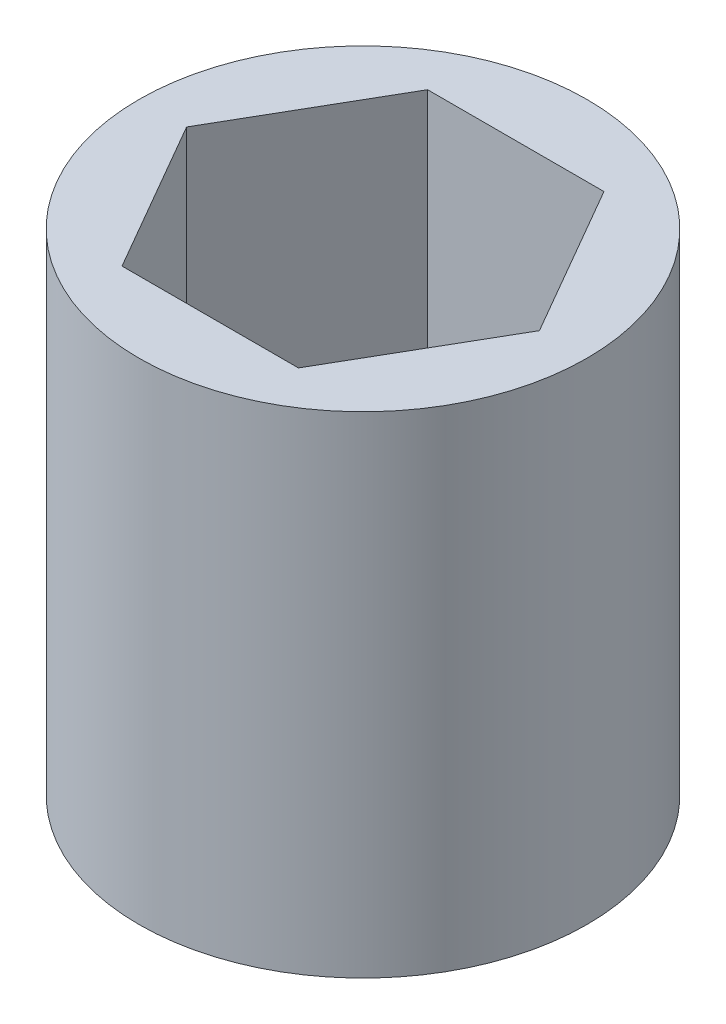
ISO-10303-21;
HEADER;
FILE_DESCRIPTION(('STEP AP214'),'2;1');
FILE_NAME('part.step','',(''),(''),'','','');
FILE_SCHEMA(('AUTOMOTIVE_DESIGN { 1 0 10303 214 1 1 1 1 }'));
ENDSEC;
DATA;
#1=APPLICATION_CONTEXT('core data for automotive mechanical design processes');
#2=APPLICATION_PROTOCOL_DEFINITION('international standard','automotive_design',2000,#1);
#3=PRODUCT_CONTEXT('',#1,'mechanical');
#4=PRODUCT('Part','Part','',(#3));
#5=PRODUCT_RELATED_PRODUCT_CATEGORY('part','',(#4));
#6=PRODUCT_DEFINITION_FORMATION('','',#4);
#7=PRODUCT_DEFINITION_CONTEXT('part definition',#1,'design');
#8=PRODUCT_DEFINITION('design','',#6,#7);
#9=PRODUCT_DEFINITION_SHAPE('','',#8);
#10=(LENGTH_UNIT() NAMED_UNIT(*) SI_UNIT(.MILLI.,.METRE.));
#11=(NAMED_UNIT(*) PLANE_ANGLE_UNIT() SI_UNIT($,.RADIAN.));
#12=(NAMED_UNIT(*) SI_UNIT($,.STERADIAN.) SOLID_ANGLE_UNIT());
#13=UNCERTAINTY_MEASURE_WITH_UNIT(LENGTH_MEASURE(1.E-05),#10,'distance_accuracy_value','');
#14=(GEOMETRIC_REPRESENTATION_CONTEXT(3) GLOBAL_UNCERTAINTY_ASSIGNED_CONTEXT((#13)) GLOBAL_UNIT_ASSIGNED_CONTEXT((#10,
#11,#12)) REPRESENTATION_CONTEXT('',''));
#15=CARTESIAN_POINT('',(0.,0.,0.));
#16=DIRECTION('',(0.,0.,1.));
#17=DIRECTION('',(1.,0.,0.));
#18=AXIS2_PLACEMENT_3D('',#15,#16,#17);
#19=CARTESIAN_POINT('',(0.,3.8227,0.));
#20=DIRECTION('',(0.,1.,0.));
#21=DIRECTION('',(0.,0.,1.));
#22=AXIS2_PLACEMENT_3D('',#19,#20,#21);
#23=PLANE('',#22);
#24=CARTESIAN_POINT('',(0.,3.8227,0.));
#25=DIRECTION('',(0.,1.,0.));
#26=DIRECTION('',(0.,0.,1.));
#27=AXIS2_PLACEMENT_3D('',#24,#25,#26);
#28=CIRCLE('',#27,3.4925);
#29=CARTESIAN_POINT('',(0.,3.8227,3.4925));
#30=VERTEX_POINT('',#29);
#31=EDGE_CURVE('E11',#30,#30,#28,.T.);
#32=ORIENTED_EDGE('',*,*,#31,.T.);
#33=EDGE_LOOP('',(#32));
#34=FACE_BOUND('',#33,.T.);
#35=DIRECTION('',(0.5,0.,-0.866025403784439));
#36=VECTOR('',#35,1.);
#37=CARTESIAN_POINT('',(1.3748153285078,3.8227,2.38125));
#38=LINE('',#37,#36);
#39=CARTESIAN_POINT('',(1.3748153285078,3.8227,2.38125));
#40=VERTEX_POINT('',#39);
#41=CARTESIAN_POINT('',(2.74963065701559,3.8227,0.));
#42=VERTEX_POINT('',#41);
#43=EDGE_CURVE('E102',#40,#42,#38,.T.);
#44=ORIENTED_EDGE('',*,*,#43,.F.);
#45=DIRECTION('',(1.,0.,0.));
#46=VECTOR('',#45,1.);
#47=CARTESIAN_POINT('',(-1.3748153285078,3.8227,2.38125));
#48=LINE('',#47,#46);
#49=CARTESIAN_POINT('',(-1.3748153285078,3.8227,2.38125));
#50=VERTEX_POINT('',#49);
#51=EDGE_CURVE('E93',#50,#40,#48,.T.);
#52=ORIENTED_EDGE('',*,*,#51,.F.);
#53=DIRECTION('',(0.5,0.,0.866025403784439));
#54=VECTOR('',#53,1.);
#55=CARTESIAN_POINT('',(-2.74963065701559,3.8227,0.));
#56=LINE('',#55,#54);
#57=CARTESIAN_POINT('',(-2.74963065701559,3.8227,0.));
#58=VERTEX_POINT('',#57);
#59=EDGE_CURVE('E127',#58,#50,#56,.T.);
#60=ORIENTED_EDGE('',*,*,#59,.F.);
#61=DIRECTION('',(-0.5,0.,0.866025403784439));
#62=VECTOR('',#61,1.);
#63=CARTESIAN_POINT('',(-1.3748153285078,3.8227,-2.38125));
#64=LINE('',#63,#62);
#65=CARTESIAN_POINT('',(-1.3748153285078,3.8227,-2.38125));
#66=VERTEX_POINT('',#65);
#67=EDGE_CURVE('E124',#66,#58,#64,.T.);
#68=ORIENTED_EDGE('',*,*,#67,.F.);
#69=DIRECTION('',(-1.,0.,0.));
#70=VECTOR('',#69,1.);
#71=CARTESIAN_POINT('',(1.3748153285078,3.8227,-2.38125));
#72=LINE('',#71,#70);
#73=CARTESIAN_POINT('',(1.3748153285078,3.8227,-2.38125));
#74=VERTEX_POINT('',#73);
#75=EDGE_CURVE('E119',#74,#66,#72,.T.);
#76=ORIENTED_EDGE('',*,*,#75,.F.);
#77=DIRECTION('',(-0.5,0.,-0.866025403784438));
#78=VECTOR('',#77,1.);
#79=CARTESIAN_POINT('',(2.74963065701559,3.8227,0.));
#80=LINE('',#79,#78);
#81=EDGE_CURVE('E115',#42,#74,#80,.T.);
#82=ORIENTED_EDGE('',*,*,#81,.F.);
#83=EDGE_LOOP('',(#44,#52,#60,#68,#76,#82));
#84=FACE_BOUND('',#83,.T.);
#85=ADVANCED_FACE('F39',(#34,#84),#23,.T.);
#86=CARTESIAN_POINT('',(0.,-3.8227,0.));
#87=DIRECTION('',(0.,1.,0.));
#88=DIRECTION('',(0.,0.,1.));
#89=AXIS2_PLACEMENT_3D('',#86,#87,#88);
#90=PLANE('',#89);
#91=CARTESIAN_POINT('',(0.,-3.8227,0.));
#92=DIRECTION('',(0.,1.,0.));
#93=DIRECTION('',(0.,0.,1.));
#94=AXIS2_PLACEMENT_3D('',#91,#92,#93);
#95=CIRCLE('',#94,3.4925);
#96=CARTESIAN_POINT('',(0.,-3.8227,3.4925));
#97=VERTEX_POINT('',#96);
#98=EDGE_CURVE('E43',#97,#97,#95,.T.);
#99=ORIENTED_EDGE('',*,*,#98,.F.);
#100=EDGE_LOOP('',(#99));
#101=FACE_BOUND('',#100,.T.);
#102=DIRECTION('',(1.,0.,0.));
#103=VECTOR('',#102,1.);
#104=CARTESIAN_POINT('',(-1.3748153285078,-3.8227,2.38125));
#105=LINE('',#104,#103);
#106=CARTESIAN_POINT('',(-1.3748153285078,-3.8227,2.38125));
#107=VERTEX_POINT('',#106);
#108=CARTESIAN_POINT('',(1.3748153285078,-3.8227,2.38125));
#109=VERTEX_POINT('',#108);
#110=EDGE_CURVE('E63',#107,#109,#105,.T.);
#111=ORIENTED_EDGE('',*,*,#110,.T.);
#112=DIRECTION('',(0.5,0.,-0.866025403784439));
#113=VECTOR('',#112,1.);
#114=CARTESIAN_POINT('',(1.3748153285078,-3.8227,2.38125));
#115=LINE('',#114,#113);
#116=CARTESIAN_POINT('',(2.74963065701559,-3.8227,0.));
#117=VERTEX_POINT('',#116);
#118=EDGE_CURVE('E109',#109,#117,#115,.T.);
#119=ORIENTED_EDGE('',*,*,#118,.T.);
#120=DIRECTION('',(-0.5,0.,-0.866025403784438));
#121=VECTOR('',#120,1.);
#122=CARTESIAN_POINT('',(2.74963065701559,-3.8227,0.));
#123=LINE('',#122,#121);
#124=CARTESIAN_POINT('',(1.3748153285078,-3.8227,-2.38125));
#125=VERTEX_POINT('',#124);
#126=EDGE_CURVE('E134',#117,#125,#123,.T.);
#127=ORIENTED_EDGE('',*,*,#126,.T.);
#128=DIRECTION('',(-1.,0.,0.));
#129=VECTOR('',#128,1.);
#130=CARTESIAN_POINT('',(1.3748153285078,-3.8227,-2.38125));
#131=LINE('',#130,#129);
#132=CARTESIAN_POINT('',(-1.3748153285078,-3.8227,-2.38125));
#133=VERTEX_POINT('',#132);
#134=EDGE_CURVE('E138',#125,#133,#131,.T.);
#135=ORIENTED_EDGE('',*,*,#134,.T.);
#136=DIRECTION('',(-0.5,0.,0.866025403784439));
#137=VECTOR('',#136,1.);
#138=CARTESIAN_POINT('',(-1.3748153285078,-3.8227,-2.38125));
#139=LINE('',#138,#137);
#140=CARTESIAN_POINT('',(-2.74963065701559,-3.8227,0.));
#141=VERTEX_POINT('',#140);
#142=EDGE_CURVE('E142',#133,#141,#139,.T.);
#143=ORIENTED_EDGE('',*,*,#142,.T.);
#144=DIRECTION('',(0.5,0.,0.866025403784439));
#145=VECTOR('',#144,1.);
#146=CARTESIAN_POINT('',(-2.74963065701559,-3.8227,0.));
#147=LINE('',#146,#145);
#148=EDGE_CURVE('E103',#141,#107,#147,.T.);
#149=ORIENTED_EDGE('',*,*,#148,.T.);
#150=EDGE_LOOP('',(#111,#119,#127,#135,#143,#149));
#151=FACE_BOUND('',#150,.T.);
#152=ADVANCED_FACE('F166',(#101,#151),#90,.F.);
#153=CARTESIAN_POINT('',(0.,3.8227,0.));
#154=DIRECTION('',(0.,-1.,0.));
#155=DIRECTION('',(0.,0.,-1.));
#156=AXIS2_PLACEMENT_3D('',#153,#154,#155);
#157=CYLINDRICAL_SURFACE('',#156,3.4925);
#158=ORIENTED_EDGE('',*,*,#31,.F.);
#159=EDGE_LOOP('',(#158));
#160=FACE_BOUND('',#159,.T.);
#161=ORIENTED_EDGE('',*,*,#98,.T.);
#162=EDGE_LOOP('',(#161));
#163=FACE_BOUND('',#162,.T.);
#164=ADVANCED_FACE('F41',(#160,#163),#157,.T.);
#165=CARTESIAN_POINT('',(-1.3748153285078,3.8227,2.38125));
#166=DIRECTION('',(0.,0.,-1.));
#167=DIRECTION('',(-1.,0.,0.));
#168=AXIS2_PLACEMENT_3D('',#165,#166,#167);
#169=PLANE('',#168);
#170=ORIENTED_EDGE('',*,*,#110,.F.);
#171=DIRECTION('',(0.,-1.,0.));
#172=VECTOR('',#171,1.);
#173=CARTESIAN_POINT('',(-1.3748153285078,3.8227,2.38125));
#174=LINE('',#173,#172);
#175=EDGE_CURVE('E97',#50,#107,#174,.T.);
#176=ORIENTED_EDGE('',*,*,#175,.F.);
#177=ORIENTED_EDGE('',*,*,#51,.T.);
#178=DIRECTION('',(0.,-1.,0.));
#179=VECTOR('',#178,1.);
#180=CARTESIAN_POINT('',(1.3748153285078,3.8227,2.38125));
#181=LINE('',#180,#179);
#182=EDGE_CURVE('E96',#40,#109,#181,.T.);
#183=ORIENTED_EDGE('',*,*,#182,.T.);
#184=EDGE_LOOP('',(#170,#176,#177,#183));
#185=FACE_BOUND('',#184,.T.);
#186=ADVANCED_FACE('F95',(#185),#169,.T.);
#187=CARTESIAN_POINT('',(1.3748153285078,3.8227,2.38125));
#188=DIRECTION('',(-0.866025403784439,0.,-0.5));
#189=DIRECTION('',(-0.5,0.,0.866025403784439));
#190=AXIS2_PLACEMENT_3D('',#187,#188,#189);
#191=PLANE('',#190);
#192=ORIENTED_EDGE('',*,*,#118,.F.);
#193=ORIENTED_EDGE('',*,*,#182,.F.);
#194=ORIENTED_EDGE('',*,*,#43,.T.);
#195=DIRECTION('',(0.,-1.,0.));
#196=VECTOR('',#195,1.);
#197=CARTESIAN_POINT('',(2.74963065701559,3.8227,0.));
#198=LINE('',#197,#196);
#199=EDGE_CURVE('E111',#42,#117,#198,.T.);
#200=ORIENTED_EDGE('',*,*,#199,.T.);
#201=EDGE_LOOP('',(#192,#193,#194,#200));
#202=FACE_BOUND('',#201,.T.);
#203=ADVANCED_FACE('F106',(#202),#191,.T.);
#204=CARTESIAN_POINT('',(2.74963065701559,3.8227,0.));
#205=DIRECTION('',(-0.866025403784438,0.,0.5));
#206=DIRECTION('',(0.5,0.,0.866025403784438));
#207=AXIS2_PLACEMENT_3D('',#204,#205,#206);
#208=PLANE('',#207);
#209=ORIENTED_EDGE('',*,*,#126,.F.);
#210=ORIENTED_EDGE('',*,*,#199,.F.);
#211=ORIENTED_EDGE('',*,*,#81,.T.);
#212=DIRECTION('',(0.,-1.,0.));
#213=VECTOR('',#212,1.);
#214=CARTESIAN_POINT('',(1.3748153285078,3.8227,-2.38125));
#215=LINE('',#214,#213);
#216=EDGE_CURVE('E156',#74,#125,#215,.T.);
#217=ORIENTED_EDGE('',*,*,#216,.T.);
#218=EDGE_LOOP('',(#209,#210,#211,#217));
#219=FACE_BOUND('',#218,.T.);
#220=ADVANCED_FACE('F162',(#219),#208,.T.);
#221=CARTESIAN_POINT('',(1.3748153285078,3.8227,-2.38125));
#222=DIRECTION('',(0.,0.,1.));
#223=DIRECTION('',(1.,0.,0.));
#224=AXIS2_PLACEMENT_3D('',#221,#222,#223);
#225=PLANE('',#224);
#226=ORIENTED_EDGE('',*,*,#134,.F.);
#227=ORIENTED_EDGE('',*,*,#216,.F.);
#228=ORIENTED_EDGE('',*,*,#75,.T.);
#229=DIRECTION('',(0.,-1.,0.));
#230=VECTOR('',#229,1.);
#231=CARTESIAN_POINT('',(-1.3748153285078,3.8227,-2.38125));
#232=LINE('',#231,#230);
#233=EDGE_CURVE('E153',#66,#133,#232,.T.);
#234=ORIENTED_EDGE('',*,*,#233,.T.);
#235=EDGE_LOOP('',(#226,#227,#228,#234));
#236=FACE_BOUND('',#235,.T.);
#237=ADVANCED_FACE('F174',(#236),#225,.T.);
#238=CARTESIAN_POINT('',(-1.3748153285078,3.8227,-2.38125));
#239=DIRECTION('',(0.866025403784439,0.,0.5));
#240=DIRECTION('',(0.5,0.,-0.866025403784439));
#241=AXIS2_PLACEMENT_3D('',#238,#239,#240);
#242=PLANE('',#241);
#243=ORIENTED_EDGE('',*,*,#142,.F.);
#244=ORIENTED_EDGE('',*,*,#233,.F.);
#245=ORIENTED_EDGE('',*,*,#67,.T.);
#246=DIRECTION('',(0.,-1.,0.));
#247=VECTOR('',#246,1.);
#248=CARTESIAN_POINT('',(-2.74963065701559,3.8227,0.));
#249=LINE('',#248,#247);
#250=EDGE_CURVE('E55',#58,#141,#249,.T.);
#251=ORIENTED_EDGE('',*,*,#250,.T.);
#252=EDGE_LOOP('',(#243,#244,#245,#251));
#253=FACE_BOUND('',#252,.T.);
#254=ADVANCED_FACE('F172',(#253),#242,.T.);
#255=CARTESIAN_POINT('',(-2.74963065701559,3.8227,0.));
#256=DIRECTION('',(0.866025403784439,0.,-0.5));
#257=DIRECTION('',(-0.5,0.,-0.866025403784439));
#258=AXIS2_PLACEMENT_3D('',#255,#256,#257);
#259=PLANE('',#258);
#260=ORIENTED_EDGE('',*,*,#148,.F.);
#261=ORIENTED_EDGE('',*,*,#250,.F.);
#262=ORIENTED_EDGE('',*,*,#59,.T.);
#263=ORIENTED_EDGE('',*,*,#175,.T.);
#264=EDGE_LOOP('',(#260,#261,#262,#263));
#265=FACE_BOUND('',#264,.T.);
#266=ADVANCED_FACE('F168',(#265),#259,.T.);
#267=CLOSED_SHELL('',(#85,#152,#164,#186,#203,#220,#237,#254,#266));
#268=MANIFOLD_SOLID_BREP('B2',#267);
#269=ADVANCED_BREP_SHAPE_REPRESENTATION('',(#18,#268),#14);
#270=SHAPE_DEFINITION_REPRESENTATION(#9,#269);
ENDSEC;
END-ISO-10303-21;
